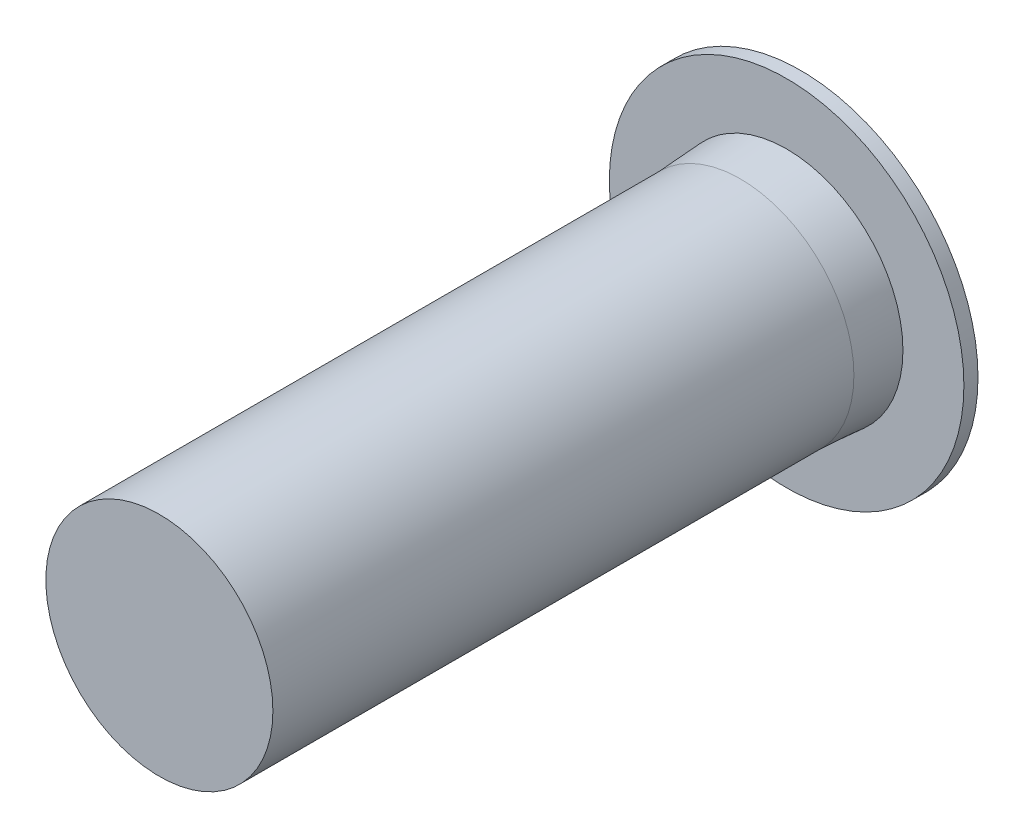
ISO-10303-21;
HEADER;
FILE_DESCRIPTION(('STEP AP214'),'2;1');
FILE_NAME('part.step','',(''),(''),'','','');
FILE_SCHEMA(('AUTOMOTIVE_DESIGN { 1 0 10303 214 1 1 1 1 }'));
ENDSEC;
DATA;
#1=APPLICATION_CONTEXT('core data for automotive mechanical design processes');
#2=APPLICATION_PROTOCOL_DEFINITION('international standard','automotive_design',2000,#1);
#3=PRODUCT_CONTEXT('',#1,'mechanical');
#4=PRODUCT('Part','Part','',(#3));
#5=PRODUCT_RELATED_PRODUCT_CATEGORY('part','',(#4));
#6=PRODUCT_DEFINITION_FORMATION('','',#4);
#7=PRODUCT_DEFINITION_CONTEXT('part definition',#1,'design');
#8=PRODUCT_DEFINITION('design','',#6,#7);
#9=PRODUCT_DEFINITION_SHAPE('','',#8);
#10=(LENGTH_UNIT() NAMED_UNIT(*) SI_UNIT(.MILLI.,.METRE.));
#11=(NAMED_UNIT(*) PLANE_ANGLE_UNIT() SI_UNIT($,.RADIAN.));
#12=(NAMED_UNIT(*) SI_UNIT($,.STERADIAN.) SOLID_ANGLE_UNIT());
#13=UNCERTAINTY_MEASURE_WITH_UNIT(LENGTH_MEASURE(1.E-05),#10,'distance_accuracy_value','');
#14=(GEOMETRIC_REPRESENTATION_CONTEXT(3) GLOBAL_UNCERTAINTY_ASSIGNED_CONTEXT((#13)) GLOBAL_UNIT_ASSIGNED_CONTEXT((#10,
#11,#12)) REPRESENTATION_CONTEXT('',''));
#15=CARTESIAN_POINT('',(0.,0.,0.));
#16=DIRECTION('',(0.,0.,1.));
#17=DIRECTION('',(1.,0.,0.));
#18=AXIS2_PLACEMENT_3D('',#15,#16,#17);
#19=CARTESIAN_POINT('',(0.,0.,2.23));
#20=DIRECTION('',(0.,0.,-1.));
#21=DIRECTION('',(-1.,0.,0.));
#22=AXIS2_PLACEMENT_3D('',#19,#20,#21);
#23=CONICAL_SURFACE('',#22,5.475,0.0604643241418104);
#24=CARTESIAN_POINT('',(0.,0.,2.23));
#25=DIRECTION('',(0.,0.,1.));
#26=DIRECTION('',(1.,0.,0.));
#27=AXIS2_PLACEMENT_3D('',#24,#25,#26);
#28=CIRCLE('',#27,5.475);
#29=CARTESIAN_POINT('',(5.475,0.,2.23));
#30=VERTEX_POINT('',#29);
#31=EDGE_CURVE('E11',#30,#30,#28,.T.);
#32=ORIENTED_EDGE('',*,*,#31,.F.);
#33=EDGE_LOOP('',(#32));
#34=FACE_BOUND('',#33,.T.);
#35=CARTESIAN_POINT('',(0.,0.,0.));
#36=DIRECTION('',(0.,0.,1.));
#37=DIRECTION('',(1.,0.,0.));
#38=AXIS2_PLACEMENT_3D('',#35,#36,#37);
#39=CIRCLE('',#38,5.61);
#40=CARTESIAN_POINT('',(5.61,0.,0.));
#41=VERTEX_POINT('',#40);
#42=EDGE_CURVE('E45',#41,#41,#39,.T.);
#43=ORIENTED_EDGE('',*,*,#42,.T.);
#44=EDGE_LOOP('',(#43));
#45=FACE_BOUND('',#44,.T.);
#46=ADVANCED_FACE('F41',(#34,#45),#23,.T.);
#47=CARTESIAN_POINT('',(0.,0.,30.25));
#48=DIRECTION('',(0.,0.,1.));
#49=DIRECTION('',(1.,0.,0.));
#50=AXIS2_PLACEMENT_3D('',#47,#48,#49);
#51=PLANE('',#50);
#52=CARTESIAN_POINT('',(0.,0.,30.25));
#53=DIRECTION('',(0.,0.,1.));
#54=DIRECTION('',(1.,0.,0.));
#55=AXIS2_PLACEMENT_3D('',#52,#53,#54);
#56=CIRCLE('',#55,5.475);
#57=CARTESIAN_POINT('',(5.475,0.,30.25));
#58=VERTEX_POINT('',#57);
#59=EDGE_CURVE('E49',#58,#58,#56,.T.);
#60=ORIENTED_EDGE('',*,*,#59,.T.);
#61=EDGE_LOOP('',(#60));
#62=FACE_BOUND('',#61,.T.);
#63=ADVANCED_FACE('F75',(#62),#51,.T.);
#64=CARTESIAN_POINT('',(0.,0.,30.25));
#65=DIRECTION('',(0.,0.,-1.));
#66=DIRECTION('',(-1.,0.,0.));
#67=AXIS2_PLACEMENT_3D('',#64,#65,#66);
#68=CYLINDRICAL_SURFACE('',#67,5.475);
#69=ORIENTED_EDGE('',*,*,#31,.T.);
#70=EDGE_LOOP('',(#69));
#71=FACE_BOUND('',#70,.T.);
#72=ORIENTED_EDGE('',*,*,#59,.F.);
#73=EDGE_LOOP('',(#72));
#74=FACE_BOUND('',#73,.T.);
#75=ADVANCED_FACE('F84',(#71,#74),#68,.T.);
#76=CARTESIAN_POINT('',(0.,0.,0.));
#77=DIRECTION('',(0.,0.,-1.));
#78=DIRECTION('',(-1.,0.,0.));
#79=AXIS2_PLACEMENT_3D('',#76,#77,#78);
#80=PLANE('',#79);
#81=CARTESIAN_POINT('',(0.,0.,0.));
#82=DIRECTION('',(0.,0.,-1.));
#83=DIRECTION('',(-1.,0.,0.));
#84=AXIS2_PLACEMENT_3D('',#81,#82,#83);
#85=CIRCLE('',#84,8.55);
#86=CARTESIAN_POINT('',(-8.55,0.,0.));
#87=VERTEX_POINT('',#86);
#88=EDGE_CURVE('E111',#87,#87,#85,.T.);
#89=ORIENTED_EDGE('',*,*,#88,.F.);
#90=EDGE_LOOP('',(#89));
#91=FACE_BOUND('',#90,.T.);
#92=ORIENTED_EDGE('',*,*,#42,.F.);
#93=EDGE_LOOP('',(#92));
#94=FACE_BOUND('',#93,.T.);
#95=ADVANCED_FACE('F90',(#91,#94),#80,.F.);
#96=CARTESIAN_POINT('',(0.,0.,-0.68));
#97=DIRECTION('',(0.,0.,1.));
#98=DIRECTION('',(1.,0.,0.));
#99=AXIS2_PLACEMENT_3D('',#96,#97,#98);
#100=CYLINDRICAL_SURFACE('',#99,8.55);
#101=CARTESIAN_POINT('',(0.,0.,-0.68));
#102=DIRECTION('',(0.,0.,-1.));
#103=DIRECTION('',(-1.,0.,0.));
#104=AXIS2_PLACEMENT_3D('',#101,#102,#103);
#105=CIRCLE('',#104,8.55);
#106=CARTESIAN_POINT('',(-8.55,0.,-0.68));
#107=VERTEX_POINT('',#106);
#108=EDGE_CURVE('E114',#107,#107,#105,.T.);
#109=ORIENTED_EDGE('',*,*,#108,.F.);
#110=EDGE_LOOP('',(#109));
#111=FACE_BOUND('',#110,.T.);
#112=ORIENTED_EDGE('',*,*,#88,.T.);
#113=EDGE_LOOP('',(#112));
#114=FACE_BOUND('',#113,.T.);
#115=ADVANCED_FACE('F86',(#111,#114),#100,.T.);
#116=CARTESIAN_POINT('',(0.,0.,-0.68));
#117=DIRECTION('',(0.,0.,-1.));
#118=DIRECTION('',(-1.,0.,0.));
#119=AXIS2_PLACEMENT_3D('',#116,#117,#118);
#120=PLANE('',#119);
#121=CARTESIAN_POINT('',(0.,0.,-0.68));
#122=DIRECTION('',(0.,0.,-1.));
#123=DIRECTION('',(-1.,0.,0.));
#124=AXIS2_PLACEMENT_3D('',#121,#122,#123);
#125=CIRCLE('',#124,4.92);
#126=CARTESIAN_POINT('',(-4.92,0.,-0.68));
#127=VERTEX_POINT('',#126);
#128=EDGE_CURVE('E118',#127,#127,#125,.T.);
#129=ORIENTED_EDGE('',*,*,#128,.F.);
#130=EDGE_LOOP('',(#129));
#131=FACE_BOUND('',#130,.T.);
#132=ORIENTED_EDGE('',*,*,#108,.T.);
#133=EDGE_LOOP('',(#132));
#134=FACE_BOUND('',#133,.T.);
#135=ADVANCED_FACE('F129',(#131,#134),#120,.T.);
#136=CARTESIAN_POINT('',(0.,0.,15.89));
#137=DIRECTION('',(0.,0.,-1.));
#138=DIRECTION('',(-1.,0.,0.));
#139=AXIS2_PLACEMENT_3D('',#136,#137,#138);
#140=CYLINDRICAL_SURFACE('',#139,4.92);
#141=CARTESIAN_POINT('',(0.,0.,15.89));
#142=DIRECTION('',(0.,0.,-1.));
#143=DIRECTION('',(-1.,0.,0.));
#144=AXIS2_PLACEMENT_3D('',#141,#142,#143);
#145=CIRCLE('',#144,4.92);
#146=CARTESIAN_POINT('',(-4.92,0.,15.89));
#147=VERTEX_POINT('',#146);
#148=EDGE_CURVE('E115',#147,#147,#145,.T.);
#149=ORIENTED_EDGE('',*,*,#148,.F.);
#150=EDGE_LOOP('',(#149));
#151=FACE_BOUND('',#150,.T.);
#152=ORIENTED_EDGE('',*,*,#128,.T.);
#153=EDGE_LOOP('',(#152));
#154=FACE_BOUND('',#153,.T.);
#155=ADVANCED_FACE('F126',(#151,#154),#140,.F.);
#156=CARTESIAN_POINT('',(0.,0.,15.89));
#157=DIRECTION('',(0.,0.,-1.));
#158=DIRECTION('',(-1.,0.,0.));
#159=AXIS2_PLACEMENT_3D('',#156,#157,#158);
#160=PLANE('',#159);
#161=ORIENTED_EDGE('',*,*,#148,.T.);
#162=EDGE_LOOP('',(#161));
#163=FACE_BOUND('',#162,.T.);
#164=ADVANCED_FACE('F124',(#163),#160,.T.);
#165=CLOSED_SHELL('',(#46,#63,#75,#95,#115,#135,#155,#164));
#166=MANIFOLD_SOLID_BREP('B2',#165);
#167=ADVANCED_BREP_SHAPE_REPRESENTATION('',(#18,#166),#14);
#168=SHAPE_DEFINITION_REPRESENTATION(#9,#167);
ENDSEC;
END-ISO-10303-21;
